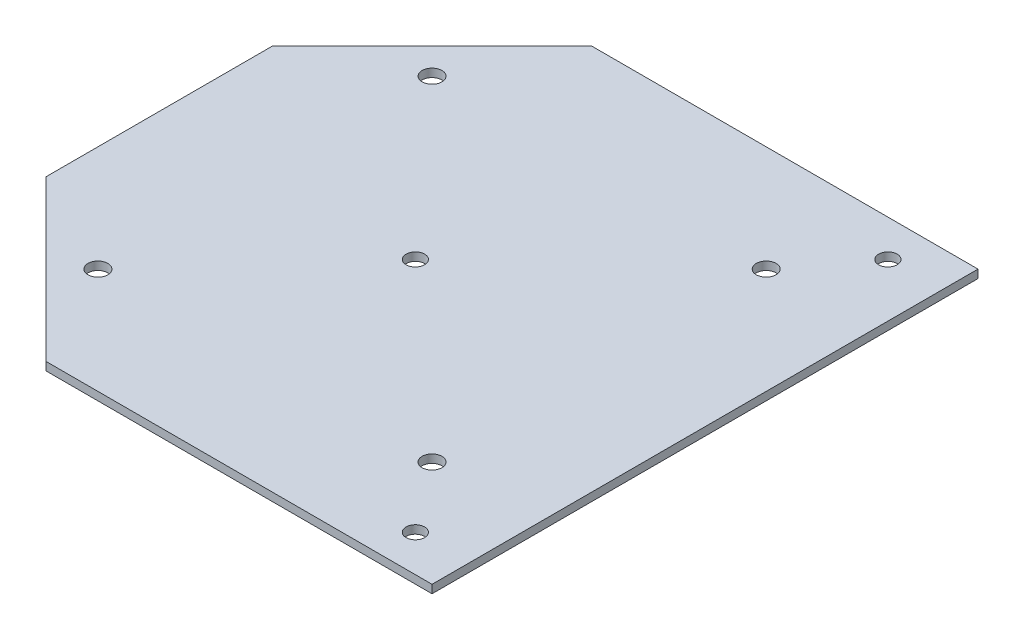
ISO-10303-21;
HEADER;
FILE_DESCRIPTION(('STEP AP214'),'2;1');
FILE_NAME('part.step','',(''),(''),'','','');
FILE_SCHEMA(('AUTOMOTIVE_DESIGN { 1 0 10303 214 1 1 1 1 }'));
ENDSEC;
DATA;
#1=APPLICATION_CONTEXT('core data for automotive mechanical design processes');
#2=APPLICATION_PROTOCOL_DEFINITION('international standard','automotive_design',2000,#1);
#3=PRODUCT_CONTEXT('',#1,'mechanical');
#4=PRODUCT('Part','Part','',(#3));
#5=PRODUCT_RELATED_PRODUCT_CATEGORY('part','',(#4));
#6=PRODUCT_DEFINITION_FORMATION('','',#4);
#7=PRODUCT_DEFINITION_CONTEXT('part definition',#1,'design');
#8=PRODUCT_DEFINITION('design','',#6,#7);
#9=PRODUCT_DEFINITION_SHAPE('','',#8);
#10=(LENGTH_UNIT() NAMED_UNIT(*) SI_UNIT(.MILLI.,.METRE.));
#11=(NAMED_UNIT(*) PLANE_ANGLE_UNIT() SI_UNIT($,.RADIAN.));
#12=(NAMED_UNIT(*) SI_UNIT($,.STERADIAN.) SOLID_ANGLE_UNIT());
#13=UNCERTAINTY_MEASURE_WITH_UNIT(LENGTH_MEASURE(1.E-05),#10,'distance_accuracy_value','');
#14=(GEOMETRIC_REPRESENTATION_CONTEXT(3) GLOBAL_UNCERTAINTY_ASSIGNED_CONTEXT((#13)) GLOBAL_UNIT_ASSIGNED_CONTEXT((#10,
#11,#12)) REPRESENTATION_CONTEXT('',''));
#15=CARTESIAN_POINT('',(0.,0.,0.));
#16=DIRECTION('',(0.,0.,1.));
#17=DIRECTION('',(1.,0.,0.));
#18=AXIS2_PLACEMENT_3D('',#15,#16,#17);
#19=CARTESIAN_POINT('',(-70.33237599072,3.,70.33237599072));
#20=DIRECTION('',(-0.707106781186548,0.,0.707106781186547));
#21=DIRECTION('',(0.707106781186547,0.,0.707106781186548));
#22=AXIS2_PLACEMENT_3D('',#19,#20,#21);
#23=PLANE('',#22);
#24=DIRECTION('',(-0.707106781186547,0.,-0.707106781186548));
#25=VECTOR('',#24,1.);
#26=CARTESIAN_POINT('',(-70.33237599072,0.,70.33237599072));
#27=LINE('',#26,#25);
#28=CARTESIAN_POINT('',(-41.1995242934893,0.,99.4652276879507));
#29=VERTEX_POINT('',#28);
#30=CARTESIAN_POINT('',(-99.4652276879507,0.,41.1995242934892));
#31=VERTEX_POINT('',#30);
#32=EDGE_CURVE('E142',#29,#31,#27,.T.);
#33=ORIENTED_EDGE('',*,*,#32,.F.);
#34=DIRECTION('',(0.,-1.,0.));
#35=VECTOR('',#34,1.);
#36=CARTESIAN_POINT('',(-41.1995242934893,3.,99.4652276879507));
#37=LINE('',#36,#35);
#38=CARTESIAN_POINT('',(-41.1995242934893,3.,99.4652276879507));
#39=VERTEX_POINT('',#38);
#40=EDGE_CURVE('E11',#39,#29,#37,.T.);
#41=ORIENTED_EDGE('',*,*,#40,.F.);
#42=DIRECTION('',(-0.707106781186547,0.,-0.707106781186548));
#43=VECTOR('',#42,1.);
#44=CARTESIAN_POINT('',(-70.33237599072,3.,70.33237599072));
#45=LINE('',#44,#43);
#46=CARTESIAN_POINT('',(-99.4652276879507,3.,41.1995242934892));
#47=VERTEX_POINT('',#46);
#48=EDGE_CURVE('E321',#39,#47,#45,.T.);
#49=ORIENTED_EDGE('',*,*,#48,.T.);
#50=DIRECTION('',(0.,-1.,0.));
#51=VECTOR('',#50,1.);
#52=CARTESIAN_POINT('',(-99.4652276879507,3.,41.1995242934892));
#53=LINE('',#52,#51);
#54=EDGE_CURVE('E81',#47,#31,#53,.T.);
#55=ORIENTED_EDGE('',*,*,#54,.T.);
#56=EDGE_LOOP('',(#33,#41,#49,#55));
#57=FACE_BOUND('',#56,.T.);
#58=ADVANCED_FACE('F35',(#57),#23,.T.);
#59=CARTESIAN_POINT('',(0.,3.,99.4652276879506));
#60=DIRECTION('',(0.,0.,-1.));
#61=DIRECTION('',(-1.,0.,0.));
#62=AXIS2_PLACEMENT_3D('',#59,#60,#61);
#63=PLANE('',#62);
#64=DIRECTION('',(1.,0.,0.));
#65=VECTOR('',#64,1.);
#66=CARTESIAN_POINT('',(0.,0.,99.4652276879506));
#67=LINE('',#66,#65);
#68=CARTESIAN_POINT('',(99.4652506094621,0.,99.4652276879506));
#69=VERTEX_POINT('',#68);
#70=EDGE_CURVE('E144',#29,#69,#67,.T.);
#71=ORIENTED_EDGE('',*,*,#70,.T.);
#72=DIRECTION('',(0.,-1.,0.));
#73=VECTOR('',#72,1.);
#74=CARTESIAN_POINT('',(99.4652506094621,3.,99.4652276879506));
#75=LINE('',#74,#73);
#76=CARTESIAN_POINT('',(99.4652506094621,3.,99.4652276879506));
#77=VERTEX_POINT('',#76);
#78=EDGE_CURVE('E44',#77,#69,#75,.T.);
#79=ORIENTED_EDGE('',*,*,#78,.F.);
#80=DIRECTION('',(1.,0.,0.));
#81=VECTOR('',#80,1.);
#82=CARTESIAN_POINT('',(0.,3.,99.4652276879506));
#83=LINE('',#82,#81);
#84=EDGE_CURVE('E116',#39,#77,#83,.T.);
#85=ORIENTED_EDGE('',*,*,#84,.F.);
#86=ORIENTED_EDGE('',*,*,#40,.T.);
#87=EDGE_LOOP('',(#71,#79,#85,#86));
#88=FACE_BOUND('',#87,.T.);
#89=ADVANCED_FACE('F163',(#88),#63,.F.);
#90=CARTESIAN_POINT('',(99.4652506094621,3.,0.));
#91=DIRECTION('',(-1.,0.,0.));
#92=DIRECTION('',(0.,0.,1.));
#93=AXIS2_PLACEMENT_3D('',#90,#91,#92);
#94=PLANE('',#93);
#95=DIRECTION('',(0.,0.,-1.));
#96=VECTOR('',#95,1.);
#97=CARTESIAN_POINT('',(99.4652506094621,0.,0.));
#98=LINE('',#97,#96);
#99=CARTESIAN_POINT('',(99.4652506094621,0.,-99.4652276879507));
#100=VERTEX_POINT('',#99);
#101=EDGE_CURVE('E147',#69,#100,#98,.T.);
#102=ORIENTED_EDGE('',*,*,#101,.T.);
#103=DIRECTION('',(0.,-1.,0.));
#104=VECTOR('',#103,1.);
#105=CARTESIAN_POINT('',(99.4652506094621,3.,-99.4652276879507));
#106=LINE('',#105,#104);
#107=CARTESIAN_POINT('',(99.4652506094621,3.,-99.4652276879507));
#108=VERTEX_POINT('',#107);
#109=EDGE_CURVE('E104',#108,#100,#106,.T.);
#110=ORIENTED_EDGE('',*,*,#109,.F.);
#111=DIRECTION('',(0.,0.,-1.));
#112=VECTOR('',#111,1.);
#113=CARTESIAN_POINT('',(99.4652506094621,3.,0.));
#114=LINE('',#113,#112);
#115=EDGE_CURVE('E113',#77,#108,#114,.T.);
#116=ORIENTED_EDGE('',*,*,#115,.F.);
#117=ORIENTED_EDGE('',*,*,#78,.T.);
#118=EDGE_LOOP('',(#102,#110,#116,#117));
#119=FACE_BOUND('',#118,.T.);
#120=ADVANCED_FACE('F160',(#119),#94,.F.);
#121=CARTESIAN_POINT('',(0.,3.,-99.4652276879507));
#122=DIRECTION('',(0.,0.,-1.));
#123=DIRECTION('',(-1.,0.,0.));
#124=AXIS2_PLACEMENT_3D('',#121,#122,#123);
#125=PLANE('',#124);
#126=DIRECTION('',(1.,0.,0.));
#127=VECTOR('',#126,1.);
#128=CARTESIAN_POINT('',(0.,0.,-99.4652276879507));
#129=LINE('',#128,#127);
#130=CARTESIAN_POINT('',(-41.1995242934893,0.,-99.4652276879507));
#131=VERTEX_POINT('',#130);
#132=EDGE_CURVE('E101',#131,#100,#129,.T.);
#133=ORIENTED_EDGE('',*,*,#132,.F.);
#134=DIRECTION('',(0.,-1.,0.));
#135=VECTOR('',#134,1.);
#136=CARTESIAN_POINT('',(-41.1995242934893,3.,-99.4652276879507));
#137=LINE('',#136,#135);
#138=CARTESIAN_POINT('',(-41.1995242934893,3.,-99.4652276879507));
#139=VERTEX_POINT('',#138);
#140=EDGE_CURVE('E95',#139,#131,#137,.T.);
#141=ORIENTED_EDGE('',*,*,#140,.F.);
#142=DIRECTION('',(1.,0.,0.));
#143=VECTOR('',#142,1.);
#144=CARTESIAN_POINT('',(0.,3.,-99.4652276879507));
#145=LINE('',#144,#143);
#146=EDGE_CURVE('E99',#139,#108,#145,.T.);
#147=ORIENTED_EDGE('',*,*,#146,.T.);
#148=ORIENTED_EDGE('',*,*,#109,.T.);
#149=EDGE_LOOP('',(#133,#141,#147,#148));
#150=FACE_BOUND('',#149,.T.);
#151=ADVANCED_FACE('F97',(#150),#125,.T.);
#152=CARTESIAN_POINT('',(-70.33237599072,3.,-70.33237599072));
#153=DIRECTION('',(0.707106781186548,0.,0.707106781186547));
#154=DIRECTION('',(0.707106781186547,0.,-0.707106781186548));
#155=AXIS2_PLACEMENT_3D('',#152,#153,#154);
#156=PLANE('',#155);
#157=DIRECTION('',(-0.707106781186547,0.,0.707106781186548));
#158=VECTOR('',#157,1.);
#159=CARTESIAN_POINT('',(-70.33237599072,0.,-70.33237599072));
#160=LINE('',#159,#158);
#161=CARTESIAN_POINT('',(-99.4652276879507,0.,-41.1995242934892));
#162=VERTEX_POINT('',#161);
#163=EDGE_CURVE('E151',#131,#162,#160,.T.);
#164=ORIENTED_EDGE('',*,*,#163,.T.);
#165=DIRECTION('',(0.,-1.,0.));
#166=VECTOR('',#165,1.);
#167=CARTESIAN_POINT('',(-99.4652276879507,3.,-41.1995242934892));
#168=LINE('',#167,#166);
#169=CARTESIAN_POINT('',(-99.4652276879507,3.,-41.1995242934892));
#170=VERTEX_POINT('',#169);
#171=EDGE_CURVE('E105',#170,#162,#168,.T.);
#172=ORIENTED_EDGE('',*,*,#171,.F.);
#173=DIRECTION('',(-0.707106781186547,0.,0.707106781186548));
#174=VECTOR('',#173,1.);
#175=CARTESIAN_POINT('',(-70.33237599072,3.,-70.33237599072));
#176=LINE('',#175,#174);
#177=EDGE_CURVE('E108',#139,#170,#176,.T.);
#178=ORIENTED_EDGE('',*,*,#177,.F.);
#179=ORIENTED_EDGE('',*,*,#140,.T.);
#180=EDGE_LOOP('',(#164,#172,#178,#179));
#181=FACE_BOUND('',#180,.T.);
#182=ADVANCED_FACE('F109',(#181),#156,.F.);
#183=CARTESIAN_POINT('',(-60.8749999999999,3.,-60.8750000000001));
#184=DIRECTION('',(0.,-1.,0.));
#185=DIRECTION('',(0.,0.,-1.));
#186=AXIS2_PLACEMENT_3D('',#183,#184,#185);
#187=CYLINDRICAL_SURFACE('',#186,3.60694572217643);
#188=CARTESIAN_POINT('',(-60.8749999999999,3.,-60.8750000000001));
#189=DIRECTION('',(0.,1.,0.));
#190=DIRECTION('',(0.,0.,1.));
#191=AXIS2_PLACEMENT_3D('',#188,#189,#190);
#192=CIRCLE('',#191,3.60694572217643);
#193=CARTESIAN_POINT('',(-60.8749999999999,3.,-57.2680542778237));
#194=VERTEX_POINT('',#193);
#195=EDGE_CURVE('E322',#194,#194,#192,.T.);
#196=ORIENTED_EDGE('',*,*,#195,.T.);
#197=EDGE_LOOP('',(#196));
#198=FACE_BOUND('',#197,.T.);
#199=CARTESIAN_POINT('',(-60.8749999999999,0.,-60.8750000000001));
#200=DIRECTION('',(0.,1.,0.));
#201=DIRECTION('',(0.,0.,1.));
#202=AXIS2_PLACEMENT_3D('',#199,#200,#201);
#203=CIRCLE('',#202,3.60694572217643);
#204=CARTESIAN_POINT('',(-60.8749999999999,0.,-57.2680542778237));
#205=VERTEX_POINT('',#204);
#206=EDGE_CURVE('E139',#205,#205,#203,.T.);
#207=ORIENTED_EDGE('',*,*,#206,.F.);
#208=EDGE_LOOP('',(#207));
#209=FACE_BOUND('',#208,.T.);
#210=ADVANCED_FACE('F173',(#198,#209),#187,.F.);
#211=CARTESIAN_POINT('',(60.8750000000003,3.,-60.8749999999997));
#212=DIRECTION('',(0.,-1.,0.));
#213=DIRECTION('',(0.,0.,-1.));
#214=AXIS2_PLACEMENT_3D('',#211,#212,#213);
#215=CYLINDRICAL_SURFACE('',#214,3.60694572217642);
#216=CARTESIAN_POINT('',(60.8750000000003,3.,-60.8749999999997));
#217=DIRECTION('',(0.,1.,0.));
#218=DIRECTION('',(0.,0.,1.));
#219=AXIS2_PLACEMENT_3D('',#216,#217,#218);
#220=CIRCLE('',#219,3.60694572217642);
#221=CARTESIAN_POINT('',(60.8750000000003,3.,-57.2680542778232));
#222=VERTEX_POINT('',#221);
#223=EDGE_CURVE('E325',#222,#222,#220,.T.);
#224=ORIENTED_EDGE('',*,*,#223,.T.);
#225=EDGE_LOOP('',(#224));
#226=FACE_BOUND('',#225,.T.);
#227=CARTESIAN_POINT('',(60.8750000000003,0.,-60.8749999999997));
#228=DIRECTION('',(0.,1.,0.));
#229=DIRECTION('',(0.,0.,1.));
#230=AXIS2_PLACEMENT_3D('',#227,#228,#229);
#231=CIRCLE('',#230,3.60694572217642);
#232=CARTESIAN_POINT('',(60.8750000000003,0.,-57.2680542778232));
#233=VERTEX_POINT('',#232);
#234=EDGE_CURVE('E136',#233,#233,#231,.T.);
#235=ORIENTED_EDGE('',*,*,#234,.F.);
#236=EDGE_LOOP('',(#235));
#237=FACE_BOUND('',#236,.T.);
#238=ADVANCED_FACE('F176',(#226,#237),#215,.F.);
#239=CARTESIAN_POINT('',(60.8749999999995,3.,60.8750000000005));
#240=DIRECTION('',(0.,-1.,0.));
#241=DIRECTION('',(0.,0.,-1.));
#242=AXIS2_PLACEMENT_3D('',#239,#240,#241);
#243=CYLINDRICAL_SURFACE('',#242,3.60694572217642);
#244=CARTESIAN_POINT('',(60.8749999999995,3.,60.8750000000005));
#245=DIRECTION('',(0.,1.,0.));
#246=DIRECTION('',(0.,0.,1.));
#247=AXIS2_PLACEMENT_3D('',#244,#245,#246);
#248=CIRCLE('',#247,3.60694572217642);
#249=CARTESIAN_POINT('',(60.8749999999995,3.,64.4819457221769));
#250=VERTEX_POINT('',#249);
#251=EDGE_CURVE('E330',#250,#250,#248,.T.);
#252=ORIENTED_EDGE('',*,*,#251,.T.);
#253=EDGE_LOOP('',(#252));
#254=FACE_BOUND('',#253,.T.);
#255=CARTESIAN_POINT('',(60.8749999999995,0.,60.8750000000005));
#256=DIRECTION('',(0.,1.,0.));
#257=DIRECTION('',(0.,0.,1.));
#258=AXIS2_PLACEMENT_3D('',#255,#256,#257);
#259=CIRCLE('',#258,3.60694572217642);
#260=CARTESIAN_POINT('',(60.8749999999995,0.,64.4819457221769));
#261=VERTEX_POINT('',#260);
#262=EDGE_CURVE('E133',#261,#261,#259,.T.);
#263=ORIENTED_EDGE('',*,*,#262,.F.);
#264=EDGE_LOOP('',(#263));
#265=FACE_BOUND('',#264,.T.);
#266=ADVANCED_FACE('F180',(#254,#265),#243,.F.);
#267=CARTESIAN_POINT('',(-60.8750000000007,3.,60.8749999999993));
#268=DIRECTION('',(0.,-1.,0.));
#269=DIRECTION('',(0.,0.,-1.));
#270=AXIS2_PLACEMENT_3D('',#267,#268,#269);
#271=CYLINDRICAL_SURFACE('',#270,3.60694572217643);
#272=CARTESIAN_POINT('',(-60.8750000000007,3.,60.8749999999993));
#273=DIRECTION('',(0.,1.,0.));
#274=DIRECTION('',(0.,0.,1.));
#275=AXIS2_PLACEMENT_3D('',#272,#273,#274);
#276=CIRCLE('',#275,3.60694572217643);
#277=CARTESIAN_POINT('',(-60.8750000000007,3.,64.4819457221757));
#278=VERTEX_POINT('',#277);
#279=EDGE_CURVE('E333',#278,#278,#276,.T.);
#280=ORIENTED_EDGE('',*,*,#279,.T.);
#281=EDGE_LOOP('',(#280));
#282=FACE_BOUND('',#281,.T.);
#283=CARTESIAN_POINT('',(-60.8750000000007,0.,60.8749999999993));
#284=DIRECTION('',(0.,1.,0.));
#285=DIRECTION('',(0.,0.,1.));
#286=AXIS2_PLACEMENT_3D('',#283,#284,#285);
#287=CIRCLE('',#286,3.60694572217643);
#288=CARTESIAN_POINT('',(-60.8750000000007,0.,64.4819457221757));
#289=VERTEX_POINT('',#288);
#290=EDGE_CURVE('E130',#289,#289,#287,.T.);
#291=ORIENTED_EDGE('',*,*,#290,.F.);
#292=EDGE_LOOP('',(#291));
#293=FACE_BOUND('',#292,.T.);
#294=ADVANCED_FACE('F184',(#282,#293),#271,.F.);
#295=CARTESIAN_POINT('',(80.0047500609787,3.,86.0902499390213));
#296=DIRECTION('',(0.,-1.,0.));
#297=DIRECTION('',(0.,0.,-1.));
#298=AXIS2_PLACEMENT_3D('',#295,#296,#297);
#299=CYLINDRICAL_SURFACE('',#298,3.37500000187563);
#300=CARTESIAN_POINT('',(80.0047500609787,3.,86.0902499390213));
#301=DIRECTION('',(0.,1.,0.));
#302=DIRECTION('',(0.,0.,1.));
#303=AXIS2_PLACEMENT_3D('',#300,#301,#302);
#304=CIRCLE('',#303,3.37500000187563);
#305=CARTESIAN_POINT('',(80.0047500609787,3.,89.4652499408969));
#306=VERTEX_POINT('',#305);
#307=EDGE_CURVE('E336',#306,#306,#304,.T.);
#308=ORIENTED_EDGE('',*,*,#307,.T.);
#309=EDGE_LOOP('',(#308));
#310=FACE_BOUND('',#309,.T.);
#311=CARTESIAN_POINT('',(80.0047500609787,0.,86.0902499390213));
#312=DIRECTION('',(0.,1.,0.));
#313=DIRECTION('',(0.,0.,1.));
#314=AXIS2_PLACEMENT_3D('',#311,#312,#313);
#315=CIRCLE('',#314,3.37500000187563);
#316=CARTESIAN_POINT('',(80.0047500609787,0.,89.4652499408969));
#317=VERTEX_POINT('',#316);
#318=EDGE_CURVE('E127',#317,#317,#315,.T.);
#319=ORIENTED_EDGE('',*,*,#318,.F.);
#320=EDGE_LOOP('',(#319));
#321=FACE_BOUND('',#320,.T.);
#322=ADVANCED_FACE('F188',(#310,#321),#299,.F.);
#323=CARTESIAN_POINT('',(-6.08550054848303,3.,-6.70440363824496E-07));
#324=DIRECTION('',(0.,-1.,0.));
#325=DIRECTION('',(0.,0.,-1.));
#326=AXIS2_PLACEMENT_3D('',#323,#324,#325);
#327=CYLINDRICAL_SURFACE('',#326,3.37500000129891);
#328=CARTESIAN_POINT('',(-6.08550054848303,3.,-6.70440363824496E-07));
#329=DIRECTION('',(0.,1.,0.));
#330=DIRECTION('',(0.,0.,1.));
#331=AXIS2_PLACEMENT_3D('',#328,#329,#330);
#332=CIRCLE('',#331,3.37500000129891);
#333=CARTESIAN_POINT('',(-6.08550054848303,3.,3.37499933085854));
#334=VERTEX_POINT('',#333);
#335=EDGE_CURVE('E203',#334,#334,#332,.T.);
#336=ORIENTED_EDGE('',*,*,#335,.T.);
#337=EDGE_LOOP('',(#336));
#338=FACE_BOUND('',#337,.T.);
#339=CARTESIAN_POINT('',(-6.08550054848303,0.,-6.70440363824496E-07));
#340=DIRECTION('',(0.,1.,0.));
#341=DIRECTION('',(0.,0.,1.));
#342=AXIS2_PLACEMENT_3D('',#339,#340,#341);
#343=CIRCLE('',#342,3.37500000129891);
#344=CARTESIAN_POINT('',(-6.08550054848303,0.,3.37499933085854));
#345=VERTEX_POINT('',#344);
#346=EDGE_CURVE('E124',#345,#345,#343,.T.);
#347=ORIENTED_EDGE('',*,*,#346,.F.);
#348=EDGE_LOOP('',(#347));
#349=FACE_BOUND('',#348,.T.);
#350=ADVANCED_FACE('F191',(#338,#349),#327,.F.);
#351=CARTESIAN_POINT('',(80.0047500609787,3.,-86.0902512799021));
#352=DIRECTION('',(0.,-1.,0.));
#353=DIRECTION('',(0.,0.,-1.));
#354=AXIS2_PLACEMENT_3D('',#351,#352,#353);
#355=CYLINDRICAL_SURFACE('',#354,3.37499999942943);
#356=CARTESIAN_POINT('',(80.0047500609787,3.,-86.0902512799021));
#357=DIRECTION('',(0.,1.,0.));
#358=DIRECTION('',(0.,0.,1.));
#359=AXIS2_PLACEMENT_3D('',#356,#357,#358);
#360=CIRCLE('',#359,3.37499999942943);
#361=CARTESIAN_POINT('',(80.0047500609787,3.,-82.7152512804727));
#362=VERTEX_POINT('',#361);
#363=EDGE_CURVE('E154',#362,#362,#360,.T.);
#364=ORIENTED_EDGE('',*,*,#363,.T.);
#365=EDGE_LOOP('',(#364));
#366=FACE_BOUND('',#365,.T.);
#367=CARTESIAN_POINT('',(80.0047500609787,0.,-86.0902512799021));
#368=DIRECTION('',(0.,1.,0.));
#369=DIRECTION('',(0.,0.,1.));
#370=AXIS2_PLACEMENT_3D('',#367,#368,#369);
#371=CIRCLE('',#370,3.37499999942943);
#372=CARTESIAN_POINT('',(80.0047500609787,0.,-82.7152512804727));
#373=VERTEX_POINT('',#372);
#374=EDGE_CURVE('E121',#373,#373,#371,.T.);
#375=ORIENTED_EDGE('',*,*,#374,.F.);
#376=EDGE_LOOP('',(#375));
#377=FACE_BOUND('',#376,.T.);
#378=ADVANCED_FACE('F37',(#366,#377),#355,.F.);
#379=CARTESIAN_POINT('',(-99.4652276879507,3.,0.));
#380=DIRECTION('',(1.,0.,0.));
#381=DIRECTION('',(0.,0.,-1.));
#382=AXIS2_PLACEMENT_3D('',#379,#380,#381);
#383=PLANE('',#382);
#384=DIRECTION('',(0.,0.,1.));
#385=VECTOR('',#384,1.);
#386=CARTESIAN_POINT('',(-99.4652276879507,0.,0.));
#387=LINE('',#386,#385);
#388=EDGE_CURVE('E74',#162,#31,#387,.T.);
#389=ORIENTED_EDGE('',*,*,#388,.T.);
#390=ORIENTED_EDGE('',*,*,#54,.F.);
#391=DIRECTION('',(0.,0.,1.));
#392=VECTOR('',#391,1.);
#393=CARTESIAN_POINT('',(-99.4652276879507,3.,0.));
#394=LINE('',#393,#392);
#395=EDGE_CURVE('E52',#170,#47,#394,.T.);
#396=ORIENTED_EDGE('',*,*,#395,.F.);
#397=ORIENTED_EDGE('',*,*,#171,.T.);
#398=EDGE_LOOP('',(#389,#390,#396,#397));
#399=FACE_BOUND('',#398,.T.);
#400=ADVANCED_FACE('F198',(#399),#383,.F.);
#401=CARTESIAN_POINT('',(0.,3.,0.));
#402=DIRECTION('',(0.,1.,0.));
#403=DIRECTION('',(0.,0.,1.));
#404=AXIS2_PLACEMENT_3D('',#401,#402,#403);
#405=PLANE('',#404);
#406=ORIENTED_EDGE('',*,*,#363,.F.);
#407=EDGE_LOOP('',(#406));
#408=FACE_BOUND('',#407,.T.);
#409=ORIENTED_EDGE('',*,*,#335,.F.);
#410=EDGE_LOOP('',(#409));
#411=FACE_BOUND('',#410,.T.);
#412=ORIENTED_EDGE('',*,*,#307,.F.);
#413=EDGE_LOOP('',(#412));
#414=FACE_BOUND('',#413,.T.);
#415=ORIENTED_EDGE('',*,*,#279,.F.);
#416=EDGE_LOOP('',(#415));
#417=FACE_BOUND('',#416,.T.);
#418=ORIENTED_EDGE('',*,*,#251,.F.);
#419=EDGE_LOOP('',(#418));
#420=FACE_BOUND('',#419,.T.);
#421=ORIENTED_EDGE('',*,*,#223,.F.);
#422=EDGE_LOOP('',(#421));
#423=FACE_BOUND('',#422,.T.);
#424=ORIENTED_EDGE('',*,*,#195,.F.);
#425=EDGE_LOOP('',(#424));
#426=FACE_BOUND('',#425,.T.);
#427=ORIENTED_EDGE('',*,*,#48,.F.);
#428=ORIENTED_EDGE('',*,*,#84,.T.);
#429=ORIENTED_EDGE('',*,*,#115,.T.);
#430=ORIENTED_EDGE('',*,*,#146,.F.);
#431=ORIENTED_EDGE('',*,*,#177,.T.);
#432=ORIENTED_EDGE('',*,*,#395,.T.);
#433=EDGE_LOOP('',(#427,#428,#429,#430,#431,#432));
#434=FACE_BOUND('',#433,.T.);
#435=ADVANCED_FACE('F111',(#408,#411,#414,#417,#420,#423,#426,#434),#405,.T.);
#436=CARTESIAN_POINT('',(0.,0.,0.));
#437=DIRECTION('',(0.,1.,0.));
#438=DIRECTION('',(0.,0.,1.));
#439=AXIS2_PLACEMENT_3D('',#436,#437,#438);
#440=PLANE('',#439);
#441=ORIENTED_EDGE('',*,*,#374,.T.);
#442=EDGE_LOOP('',(#441));
#443=FACE_BOUND('',#442,.T.);
#444=ORIENTED_EDGE('',*,*,#346,.T.);
#445=EDGE_LOOP('',(#444));
#446=FACE_BOUND('',#445,.T.);
#447=ORIENTED_EDGE('',*,*,#318,.T.);
#448=EDGE_LOOP('',(#447));
#449=FACE_BOUND('',#448,.T.);
#450=ORIENTED_EDGE('',*,*,#290,.T.);
#451=EDGE_LOOP('',(#450));
#452=FACE_BOUND('',#451,.T.);
#453=ORIENTED_EDGE('',*,*,#262,.T.);
#454=EDGE_LOOP('',(#453));
#455=FACE_BOUND('',#454,.T.);
#456=ORIENTED_EDGE('',*,*,#234,.T.);
#457=EDGE_LOOP('',(#456));
#458=FACE_BOUND('',#457,.T.);
#459=ORIENTED_EDGE('',*,*,#206,.T.);
#460=EDGE_LOOP('',(#459));
#461=FACE_BOUND('',#460,.T.);
#462=ORIENTED_EDGE('',*,*,#32,.T.);
#463=ORIENTED_EDGE('',*,*,#388,.F.);
#464=ORIENTED_EDGE('',*,*,#163,.F.);
#465=ORIENTED_EDGE('',*,*,#132,.T.);
#466=ORIENTED_EDGE('',*,*,#101,.F.);
#467=ORIENTED_EDGE('',*,*,#70,.F.);
#468=EDGE_LOOP('',(#462,#463,#464,#465,#466,#467));
#469=FACE_BOUND('',#468,.T.);
#470=ADVANCED_FACE('F164',(#443,#446,#449,#452,#455,#458,#461,#469),#440,.F.);
#471=CLOSED_SHELL('',(#58,#89,#120,#151,#182,#210,#238,#266,#294,#322,#350,#378,#400,#435,#470));
#472=MANIFOLD_SOLID_BREP('B2',#471);
#473=ADVANCED_BREP_SHAPE_REPRESENTATION('',(#18,#472),#14);
#474=SHAPE_DEFINITION_REPRESENTATION(#9,#473);
ENDSEC;
END-ISO-10303-21;
